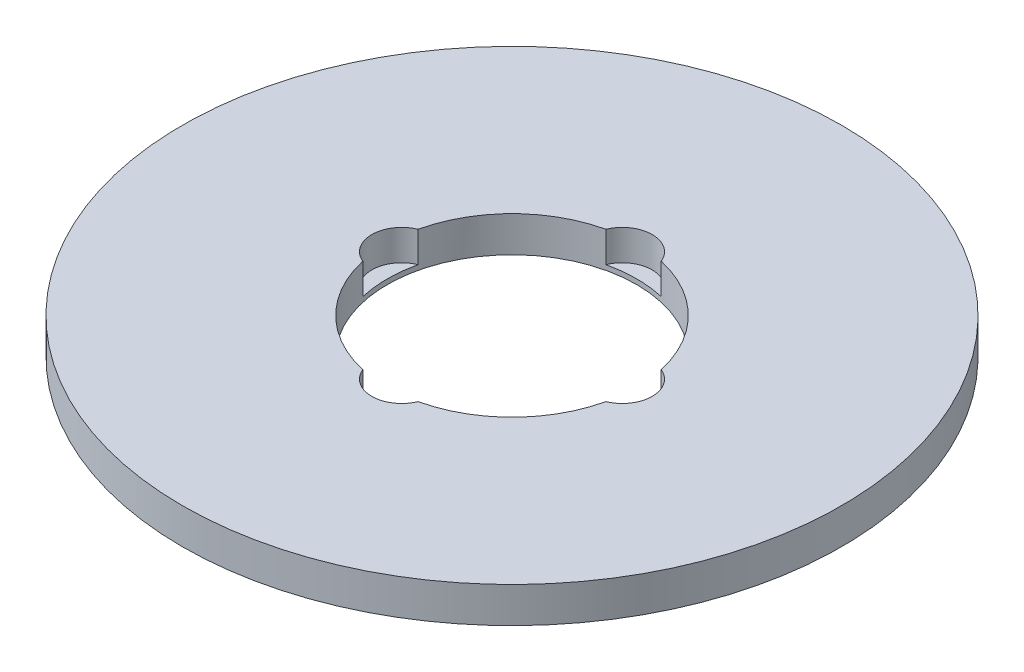
ISO-10303-21;
HEADER;
FILE_DESCRIPTION(('STEP AP214'),'2;1');
FILE_NAME('part.step','',(''),(''),'','','');
FILE_SCHEMA(('AUTOMOTIVE_DESIGN { 1 0 10303 214 1 1 1 1 }'));
ENDSEC;
DATA;
#1=APPLICATION_CONTEXT('core data for automotive mechanical design processes');
#2=APPLICATION_PROTOCOL_DEFINITION('international standard','automotive_design',2000,#1);
#3=PRODUCT_CONTEXT('',#1,'mechanical');
#4=PRODUCT('Part','Part','',(#3));
#5=PRODUCT_RELATED_PRODUCT_CATEGORY('part','',(#4));
#6=PRODUCT_DEFINITION_FORMATION('','',#4);
#7=PRODUCT_DEFINITION_CONTEXT('part definition',#1,'design');
#8=PRODUCT_DEFINITION('design','',#6,#7);
#9=PRODUCT_DEFINITION_SHAPE('','',#8);
#10=(LENGTH_UNIT() NAMED_UNIT(*) SI_UNIT(.MILLI.,.METRE.));
#11=(NAMED_UNIT(*) PLANE_ANGLE_UNIT() SI_UNIT($,.RADIAN.));
#12=(NAMED_UNIT(*) SI_UNIT($,.STERADIAN.) SOLID_ANGLE_UNIT());
#13=UNCERTAINTY_MEASURE_WITH_UNIT(LENGTH_MEASURE(1.E-05),#10,'distance_accuracy_value','');
#14=(GEOMETRIC_REPRESENTATION_CONTEXT(3) GLOBAL_UNCERTAINTY_ASSIGNED_CONTEXT((#13)) GLOBAL_UNIT_ASSIGNED_CONTEXT((#10,
#11,#12)) REPRESENTATION_CONTEXT('',''));
#15=CARTESIAN_POINT('',(0.,0.,0.));
#16=DIRECTION('',(0.,0.,1.));
#17=DIRECTION('',(1.,0.,0.));
#18=AXIS2_PLACEMENT_3D('',#15,#16,#17);
#19=CARTESIAN_POINT('',(0.,10.,0.));
#20=DIRECTION('',(0.,-1.,0.));
#21=DIRECTION('',(0.,0.,-1.));
#22=AXIS2_PLACEMENT_3D('',#19,#20,#21);
#23=CYLINDRICAL_SURFACE('',#22,92.5);
#24=CARTESIAN_POINT('',(0.,10.,0.));
#25=DIRECTION('',(0.,1.,0.));
#26=DIRECTION('',(0.,0.,1.));
#27=AXIS2_PLACEMENT_3D('',#24,#25,#26);
#28=CIRCLE('',#27,92.5);
#29=CARTESIAN_POINT('',(0.,10.,92.5));
#30=VERTEX_POINT('',#29);
#31=EDGE_CURVE('E148',#30,#30,#28,.T.);
#32=ORIENTED_EDGE('',*,*,#31,.F.);
#33=EDGE_LOOP('',(#32));
#34=FACE_BOUND('',#33,.T.);
#35=CARTESIAN_POINT('',(0.,0.,0.));
#36=DIRECTION('',(0.,1.,0.));
#37=DIRECTION('',(0.,0.,1.));
#38=AXIS2_PLACEMENT_3D('',#35,#36,#37);
#39=CIRCLE('',#38,92.5);
#40=CARTESIAN_POINT('',(0.,0.,92.5));
#41=VERTEX_POINT('',#40);
#42=EDGE_CURVE('E139',#41,#41,#39,.T.);
#43=ORIENTED_EDGE('',*,*,#42,.T.);
#44=EDGE_LOOP('',(#43));
#45=FACE_BOUND('',#44,.T.);
#46=ADVANCED_FACE('F39',(#34,#45),#23,.T.);
#47=CARTESIAN_POINT('',(0.,10.,0.));
#48=DIRECTION('',(0.,1.,0.));
#49=DIRECTION('',(0.,0.,1.));
#50=AXIS2_PLACEMENT_3D('',#47,#48,#49);
#51=PLANE('',#50);
#52=CARTESIAN_POINT('',(1.08145108584491E-13,10.,30.9739901460632));
#53=DIRECTION('',(0.,1.,0.));
#54=DIRECTION('',(1.,0.,0.));
#55=AXIS2_PLACEMENT_3D('',#52,#53,#54);
#56=CIRCLE('',#55,8.37703679079312);
#57=CARTESIAN_POINT('',(-7.76025807632839,10.,34.1288498866982));
#58=VERTEX_POINT('',#57);
#59=CARTESIAN_POINT('',(7.76025807632863,10.,34.1288498866982));
#60=VERTEX_POINT('',#59);
#61=EDGE_CURVE('E175',#58,#60,#56,.T.);
#62=ORIENTED_EDGE('',*,*,#61,.F.);
#63=CARTESIAN_POINT('',(0.,10.,0.));
#64=DIRECTION('',(0.,1.,0.));
#65=DIRECTION('',(0.,0.,1.));
#66=AXIS2_PLACEMENT_3D('',#63,#64,#65);
#67=CIRCLE('',#66,35.);
#68=CARTESIAN_POINT('',(-34.1288498866982,10.,7.76025807632851));
#69=VERTEX_POINT('',#68);
#70=EDGE_CURVE('E134',#69,#58,#67,.T.);
#71=ORIENTED_EDGE('',*,*,#70,.F.);
#72=CARTESIAN_POINT('',(-30.9739901460632,10.,0.));
#73=DIRECTION('',(0.,1.,0.));
#74=DIRECTION('',(0.,0.,1.));
#75=AXIS2_PLACEMENT_3D('',#72,#73,#74);
#76=CIRCLE('',#75,8.37703679079312);
#77=CARTESIAN_POINT('',(-34.1288498866982,10.,-7.76025807632851));
#78=VERTEX_POINT('',#77);
#79=EDGE_CURVE('E143',#78,#69,#76,.T.);
#80=ORIENTED_EDGE('',*,*,#79,.F.);
#81=CARTESIAN_POINT('',(-7.76025807632887,10.,-34.1288498866981));
#82=VERTEX_POINT('',#81);
#83=EDGE_CURVE('E123',#82,#78,#67,.T.);
#84=ORIENTED_EDGE('',*,*,#83,.F.);
#85=CARTESIAN_POINT('',(-3.24435325753472E-13,10.,-30.9739901460632));
#86=DIRECTION('',(0.,1.,0.));
#87=DIRECTION('',(-1.,0.,0.));
#88=AXIS2_PLACEMENT_3D('',#85,#86,#87);
#89=CIRCLE('',#88,8.37703679079312);
#90=CARTESIAN_POINT('',(7.76025807632815,10.,-34.1288498866983));
#91=VERTEX_POINT('',#90);
#92=EDGE_CURVE('E106',#91,#82,#89,.T.);
#93=ORIENTED_EDGE('',*,*,#92,.F.);
#94=CARTESIAN_POINT('',(34.1288498866982,10.,-7.76025807632851));
#95=VERTEX_POINT('',#94);
#96=EDGE_CURVE('E125',#95,#91,#67,.T.);
#97=ORIENTED_EDGE('',*,*,#96,.F.);
#98=CARTESIAN_POINT('',(30.9739901460632,10.,0.));
#99=DIRECTION('',(0.,1.,0.));
#100=DIRECTION('',(0.,0.,-1.));
#101=AXIS2_PLACEMENT_3D('',#98,#99,#100);
#102=CIRCLE('',#101,8.37703679079312);
#103=CARTESIAN_POINT('',(34.1288498866982,10.,7.76025807632851));
#104=VERTEX_POINT('',#103);
#105=EDGE_CURVE('E286',#104,#95,#102,.T.);
#106=ORIENTED_EDGE('',*,*,#105,.F.);
#107=EDGE_CURVE('E135',#60,#104,#67,.T.);
#108=ORIENTED_EDGE('',*,*,#107,.F.);
#109=EDGE_LOOP('',(#62,#71,#80,#84,#93,#97,#106,#108));
#110=FACE_BOUND('',#109,.T.);
#111=ORIENTED_EDGE('',*,*,#31,.T.);
#112=EDGE_LOOP('',(#111));
#113=FACE_BOUND('',#112,.T.);
#114=ADVANCED_FACE('F118',(#110,#113),#51,.T.);
#115=CARTESIAN_POINT('',(0.,0.,0.));
#116=DIRECTION('',(0.,1.,0.));
#117=DIRECTION('',(0.,0.,1.));
#118=AXIS2_PLACEMENT_3D('',#115,#116,#117);
#119=PLANE('',#118);
#120=CARTESIAN_POINT('',(0.,0.,0.));
#121=DIRECTION('',(0.,1.,0.));
#122=DIRECTION('',(0.,0.,1.));
#123=AXIS2_PLACEMENT_3D('',#120,#121,#122);
#124=CIRCLE('',#123,35.);
#125=CARTESIAN_POINT('',(0.,0.,35.));
#126=VERTEX_POINT('',#125);
#127=EDGE_CURVE('E136',#126,#126,#124,.T.);
#128=ORIENTED_EDGE('',*,*,#127,.T.);
#129=EDGE_LOOP('',(#128));
#130=FACE_BOUND('',#129,.T.);
#131=ORIENTED_EDGE('',*,*,#42,.F.);
#132=EDGE_LOOP('',(#131));
#133=FACE_BOUND('',#132,.T.);
#134=ADVANCED_FACE('F187',(#130,#133),#119,.F.);
#135=CARTESIAN_POINT('',(0.,10.,0.));
#136=DIRECTION('',(0.,-1.,0.));
#137=DIRECTION('',(0.,0.,-1.));
#138=AXIS2_PLACEMENT_3D('',#135,#136,#137);
#139=CYLINDRICAL_SURFACE('',#138,35.);
#140=DIRECTION('',(0.,1.,0.));
#141=VECTOR('',#140,1.);
#142=CARTESIAN_POINT('',(-7.76025807632839,5.69818008800627,34.1288498866982));
#143=LINE('',#142,#141);
#144=CARTESIAN_POINT('',(-7.76025807632839,1.39636017601254,34.1288498866982));
#145=VERTEX_POINT('',#144);
#146=EDGE_CURVE('E11',#145,#58,#143,.T.);
#147=ORIENTED_EDGE('',*,*,#146,.F.);
#148=CARTESIAN_POINT('',(0.,1.39636017601254,0.));
#149=DIRECTION('',(0.,1.,0.));
#150=DIRECTION('',(0.,0.,1.));
#151=AXIS2_PLACEMENT_3D('',#148,#149,#150);
#152=CIRCLE('',#151,35.);
#153=CARTESIAN_POINT('',(7.76025807632863,1.39636017601254,34.1288498866982));
#154=VERTEX_POINT('',#153);
#155=EDGE_CURVE('E170',#145,#154,#152,.T.);
#156=ORIENTED_EDGE('',*,*,#155,.T.);
#157=DIRECTION('',(0.,1.,0.));
#158=VECTOR('',#157,1.);
#159=CARTESIAN_POINT('',(7.76025807632863,5.69818008800627,34.1288498866982));
#160=LINE('',#159,#158);
#161=EDGE_CURVE('E46',#60,#154,#160,.F.);
#162=ORIENTED_EDGE('',*,*,#161,.F.);
#163=ORIENTED_EDGE('',*,*,#107,.T.);
#164=DIRECTION('',(0.,1.,0.));
#165=VECTOR('',#164,1.);
#166=CARTESIAN_POINT('',(34.1288498866982,5.69818008800627,7.76025807632851));
#167=LINE('',#166,#165);
#168=CARTESIAN_POINT('',(34.1288498866982,1.39636017601254,7.76025807632851));
#169=VERTEX_POINT('',#168);
#170=EDGE_CURVE('E164',#169,#104,#167,.T.);
#171=ORIENTED_EDGE('',*,*,#170,.F.);
#172=CARTESIAN_POINT('',(0.,1.39636017601254,0.));
#173=DIRECTION('',(0.,1.,0.));
#174=DIRECTION('',(0.,0.,1.));
#175=AXIS2_PLACEMENT_3D('',#172,#173,#174);
#176=CIRCLE('',#175,35.);
#177=CARTESIAN_POINT('',(34.1288498866982,1.39636017601254,-7.76025807632851));
#178=VERTEX_POINT('',#177);
#179=EDGE_CURVE('E115',#169,#178,#176,.T.);
#180=ORIENTED_EDGE('',*,*,#179,.T.);
#181=DIRECTION('',(0.,1.,0.));
#182=VECTOR('',#181,1.);
#183=CARTESIAN_POINT('',(34.1288498866982,5.69818008800627,-7.76025807632851));
#184=LINE('',#183,#182);
#185=EDGE_CURVE('E131',#95,#178,#184,.F.);
#186=ORIENTED_EDGE('',*,*,#185,.F.);
#187=ORIENTED_EDGE('',*,*,#96,.T.);
#188=DIRECTION('',(0.,1.,0.));
#189=VECTOR('',#188,1.);
#190=CARTESIAN_POINT('',(7.76025807632815,5.69818008800627,-34.1288498866983));
#191=LINE('',#190,#189);
#192=CARTESIAN_POINT('',(7.76025807632815,1.39636017601254,-34.1288498866983));
#193=VERTEX_POINT('',#192);
#194=EDGE_CURVE('E105',#193,#91,#191,.T.);
#195=ORIENTED_EDGE('',*,*,#194,.F.);
#196=CARTESIAN_POINT('',(0.,1.39636017601254,0.));
#197=DIRECTION('',(0.,1.,0.));
#198=DIRECTION('',(0.,0.,1.));
#199=AXIS2_PLACEMENT_3D('',#196,#197,#198);
#200=CIRCLE('',#199,35.);
#201=CARTESIAN_POINT('',(-7.76025807632887,1.39636017601254,-34.1288498866981));
#202=VERTEX_POINT('',#201);
#203=EDGE_CURVE('E159',#193,#202,#200,.T.);
#204=ORIENTED_EDGE('',*,*,#203,.T.);
#205=DIRECTION('',(0.,1.,0.));
#206=VECTOR('',#205,1.);
#207=CARTESIAN_POINT('',(-7.76025807632886,5.69818008800627,-34.1288498866981));
#208=LINE('',#207,#206);
#209=EDGE_CURVE('E114',#82,#202,#208,.F.);
#210=ORIENTED_EDGE('',*,*,#209,.F.);
#211=ORIENTED_EDGE('',*,*,#83,.T.);
#212=DIRECTION('',(0.,1.,0.));
#213=VECTOR('',#212,1.);
#214=CARTESIAN_POINT('',(-34.1288498866982,5.69818008800627,-7.76025807632851));
#215=LINE('',#214,#213);
#216=CARTESIAN_POINT('',(-34.1288498866982,1.39636017601254,-7.76025807632851));
#217=VERTEX_POINT('',#216);
#218=EDGE_CURVE('E160',#217,#78,#215,.T.);
#219=ORIENTED_EDGE('',*,*,#218,.F.);
#220=CARTESIAN_POINT('',(0.,1.39636017601254,0.));
#221=DIRECTION('',(0.,1.,0.));
#222=DIRECTION('',(0.,0.,1.));
#223=AXIS2_PLACEMENT_3D('',#220,#221,#222);
#224=CIRCLE('',#223,35.);
#225=CARTESIAN_POINT('',(-34.1288498866982,1.39636017601254,7.76025807632851));
#226=VERTEX_POINT('',#225);
#227=EDGE_CURVE('E149',#217,#226,#224,.T.);
#228=ORIENTED_EDGE('',*,*,#227,.T.);
#229=DIRECTION('',(0.,1.,0.));
#230=VECTOR('',#229,1.);
#231=CARTESIAN_POINT('',(-34.1288498866982,5.69818008800627,7.76025807632851));
#232=LINE('',#231,#230);
#233=EDGE_CURVE('E152',#69,#226,#232,.F.);
#234=ORIENTED_EDGE('',*,*,#233,.F.);
#235=ORIENTED_EDGE('',*,*,#70,.T.);
#236=EDGE_LOOP('',(#147,#156,#162,#163,#171,#180,#186,#187,#195,#204,#210,#211,#219,#228,#234,#235));
#237=FACE_BOUND('',#236,.T.);
#238=ORIENTED_EDGE('',*,*,#127,.F.);
#239=EDGE_LOOP('',(#238));
#240=FACE_BOUND('',#239,.T.);
#241=ADVANCED_FACE('F126',(#237,#240),#139,.F.);
#242=CARTESIAN_POINT('',(-30.9739901460632,1.39636017601254,0.));
#243=DIRECTION('',(0.,1.,0.));
#244=DIRECTION('',(0.,0.,1.));
#245=AXIS2_PLACEMENT_3D('',#242,#243,#244);
#246=CYLINDRICAL_SURFACE('',#245,8.37703679079312);
#247=ORIENTED_EDGE('',*,*,#218,.T.);
#248=ORIENTED_EDGE('',*,*,#79,.T.);
#249=ORIENTED_EDGE('',*,*,#233,.T.);
#250=CARTESIAN_POINT('',(-30.9739901460632,1.39636017601254,0.));
#251=DIRECTION('',(0.,1.,0.));
#252=DIRECTION('',(0.,0.,1.));
#253=AXIS2_PLACEMENT_3D('',#250,#251,#252);
#254=CIRCLE('',#253,8.37703679079312);
#255=EDGE_CURVE('E144',#217,#226,#254,.T.);
#256=ORIENTED_EDGE('',*,*,#255,.F.);
#257=EDGE_LOOP('',(#247,#248,#249,#256));
#258=FACE_BOUND('',#257,.T.);
#259=ADVANCED_FACE('F200',(#258),#246,.F.);
#260=CARTESIAN_POINT('',(-30.9739901460632,1.39636017601254,0.));
#261=DIRECTION('',(0.,1.,0.));
#262=DIRECTION('',(0.,0.,1.));
#263=AXIS2_PLACEMENT_3D('',#260,#261,#262);
#264=PLANE('',#263);
#265=ORIENTED_EDGE('',*,*,#255,.T.);
#266=ORIENTED_EDGE('',*,*,#227,.F.);
#267=EDGE_LOOP('',(#265,#266));
#268=FACE_BOUND('',#267,.T.);
#269=ADVANCED_FACE('F201',(#268),#264,.T.);
#270=CARTESIAN_POINT('',(-3.24435325753472E-13,1.39636017601254,-30.9739901460632));
#271=DIRECTION('',(0.,1.,0.));
#272=DIRECTION('',(0.,0.,1.));
#273=AXIS2_PLACEMENT_3D('',#270,#271,#272);
#274=CYLINDRICAL_SURFACE('',#273,8.37703679079312);
#275=ORIENTED_EDGE('',*,*,#194,.T.);
#276=ORIENTED_EDGE('',*,*,#92,.T.);
#277=ORIENTED_EDGE('',*,*,#209,.T.);
#278=CARTESIAN_POINT('',(-3.24435325753472E-13,1.39636017601254,-30.9739901460632));
#279=DIRECTION('',(0.,1.,0.));
#280=DIRECTION('',(-1.,0.,0.));
#281=AXIS2_PLACEMENT_3D('',#278,#279,#280);
#282=CIRCLE('',#281,8.37703679079312);
#283=EDGE_CURVE('E107',#193,#202,#282,.T.);
#284=ORIENTED_EDGE('',*,*,#283,.F.);
#285=EDGE_LOOP('',(#275,#276,#277,#284));
#286=FACE_BOUND('',#285,.T.);
#287=ADVANCED_FACE('F102',(#286),#274,.F.);
#288=CARTESIAN_POINT('',(-3.24435325753472E-13,1.39636017601254,-30.9739901460632));
#289=DIRECTION('',(0.,1.,0.));
#290=DIRECTION('',(-1.,0.,0.));
#291=AXIS2_PLACEMENT_3D('',#288,#289,#290);
#292=PLANE('',#291);
#293=ORIENTED_EDGE('',*,*,#283,.T.);
#294=ORIENTED_EDGE('',*,*,#203,.F.);
#295=EDGE_LOOP('',(#293,#294));
#296=FACE_BOUND('',#295,.T.);
#297=ADVANCED_FACE('F209',(#296),#292,.T.);
#298=CARTESIAN_POINT('',(30.9739901460632,1.39636017601254,0.));
#299=DIRECTION('',(0.,1.,0.));
#300=DIRECTION('',(0.,0.,1.));
#301=AXIS2_PLACEMENT_3D('',#298,#299,#300);
#302=CYLINDRICAL_SURFACE('',#301,8.37703679079312);
#303=ORIENTED_EDGE('',*,*,#170,.T.);
#304=ORIENTED_EDGE('',*,*,#105,.T.);
#305=ORIENTED_EDGE('',*,*,#185,.T.);
#306=CARTESIAN_POINT('',(30.9739901460632,1.39636017601254,0.));
#307=DIRECTION('',(0.,1.,0.));
#308=DIRECTION('',(0.,0.,-1.));
#309=AXIS2_PLACEMENT_3D('',#306,#307,#308);
#310=CIRCLE('',#309,8.37703679079312);
#311=EDGE_CURVE('E56',#169,#178,#310,.T.);
#312=ORIENTED_EDGE('',*,*,#311,.F.);
#313=EDGE_LOOP('',(#303,#304,#305,#312));
#314=FACE_BOUND('',#313,.T.);
#315=ADVANCED_FACE('F213',(#314),#302,.F.);
#316=CARTESIAN_POINT('',(30.9739901460632,1.39636017601254,0.));
#317=DIRECTION('',(0.,1.,0.));
#318=DIRECTION('',(0.,0.,-1.));
#319=AXIS2_PLACEMENT_3D('',#316,#317,#318);
#320=PLANE('',#319);
#321=ORIENTED_EDGE('',*,*,#311,.T.);
#322=ORIENTED_EDGE('',*,*,#179,.F.);
#323=EDGE_LOOP('',(#321,#322));
#324=FACE_BOUND('',#323,.T.);
#325=ADVANCED_FACE('F179',(#324),#320,.T.);
#326=CARTESIAN_POINT('',(1.08145108584491E-13,1.39636017601254,30.9739901460632));
#327=DIRECTION('',(0.,1.,0.));
#328=DIRECTION('',(0.,0.,1.));
#329=AXIS2_PLACEMENT_3D('',#326,#327,#328);
#330=CYLINDRICAL_SURFACE('',#329,8.37703679079312);
#331=ORIENTED_EDGE('',*,*,#146,.T.);
#332=ORIENTED_EDGE('',*,*,#61,.T.);
#333=ORIENTED_EDGE('',*,*,#161,.T.);
#334=CARTESIAN_POINT('',(1.08145108584491E-13,1.39636017601254,30.9739901460632));
#335=DIRECTION('',(0.,1.,0.));
#336=DIRECTION('',(1.,0.,0.));
#337=AXIS2_PLACEMENT_3D('',#334,#335,#336);
#338=CIRCLE('',#337,8.37703679079312);
#339=EDGE_CURVE('E55',#145,#154,#338,.T.);
#340=ORIENTED_EDGE('',*,*,#339,.F.);
#341=EDGE_LOOP('',(#331,#332,#333,#340));
#342=FACE_BOUND('',#341,.T.);
#343=ADVANCED_FACE('F171',(#342),#330,.F.);
#344=CARTESIAN_POINT('',(1.08145108584491E-13,1.39636017601254,30.9739901460632));
#345=DIRECTION('',(0.,1.,0.));
#346=DIRECTION('',(1.,0.,0.));
#347=AXIS2_PLACEMENT_3D('',#344,#345,#346);
#348=PLANE('',#347);
#349=ORIENTED_EDGE('',*,*,#339,.T.);
#350=ORIENTED_EDGE('',*,*,#155,.F.);
#351=EDGE_LOOP('',(#349,#350));
#352=FACE_BOUND('',#351,.T.);
#353=ADVANCED_FACE('F173',(#352),#348,.T.);
#354=CLOSED_SHELL('',(#46,#114,#134,#241,#259,#269,#287,#297,#315,#325,#343,#353));
#355=MANIFOLD_SOLID_BREP('B2',#354);
#356=ADVANCED_BREP_SHAPE_REPRESENTATION('',(#18,#355),#14);
#357=SHAPE_DEFINITION_REPRESENTATION(#9,#356);
ENDSEC;
END-ISO-10303-21;
